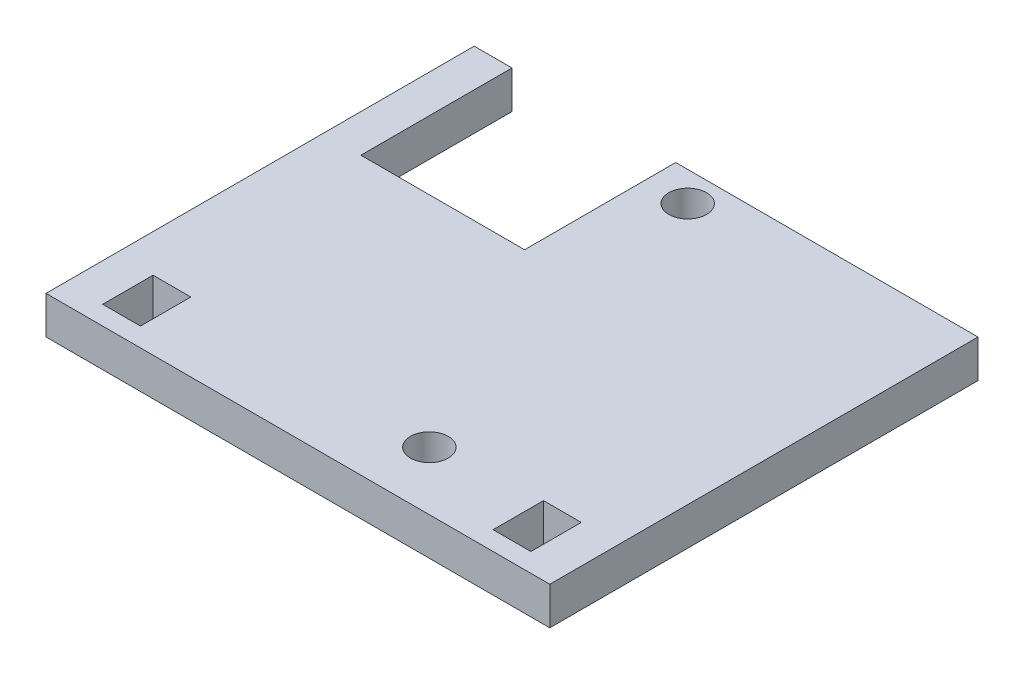
ISO-10303-21;
HEADER;
FILE_DESCRIPTION(('STEP AP214'),'2;1');
FILE_NAME('part.step','',(''),(''),'','','');
FILE_SCHEMA(('AUTOMOTIVE_DESIGN { 1 0 10303 214 1 1 1 1 }'));
ENDSEC;
DATA;
#1=APPLICATION_CONTEXT('core data for automotive mechanical design processes');
#2=APPLICATION_PROTOCOL_DEFINITION('international standard','automotive_design',2000,#1);
#3=PRODUCT_CONTEXT('',#1,'mechanical');
#4=PRODUCT('Part','Part','',(#3));
#5=PRODUCT_RELATED_PRODUCT_CATEGORY('part','',(#4));
#6=PRODUCT_DEFINITION_FORMATION('','',#4);
#7=PRODUCT_DEFINITION_CONTEXT('part definition',#1,'design');
#8=PRODUCT_DEFINITION('design','',#6,#7);
#9=PRODUCT_DEFINITION_SHAPE('','',#8);
#10=(LENGTH_UNIT() NAMED_UNIT(*) SI_UNIT(.MILLI.,.METRE.));
#11=(NAMED_UNIT(*) PLANE_ANGLE_UNIT() SI_UNIT($,.RADIAN.));
#12=(NAMED_UNIT(*) SI_UNIT($,.STERADIAN.) SOLID_ANGLE_UNIT());
#13=UNCERTAINTY_MEASURE_WITH_UNIT(LENGTH_MEASURE(1.E-05),#10,'distance_accuracy_value','');
#14=(GEOMETRIC_REPRESENTATION_CONTEXT(3) GLOBAL_UNCERTAINTY_ASSIGNED_CONTEXT((#13)) GLOBAL_UNIT_ASSIGNED_CONTEXT((#10,
#11,#12)) REPRESENTATION_CONTEXT('',''));
#15=CARTESIAN_POINT('',(0.,0.,0.));
#16=DIRECTION('',(0.,0.,1.));
#17=DIRECTION('',(1.,0.,0.));
#18=AXIS2_PLACEMENT_3D('',#15,#16,#17);
#19=CARTESIAN_POINT('',(0.,3.,0.));
#20=DIRECTION('',(0.,-1.,0.));
#21=DIRECTION('',(0.,0.,-1.));
#22=AXIS2_PLACEMENT_3D('',#19,#20,#21);
#23=PLANE('',#22);
#24=CARTESIAN_POINT('',(19.3,3.,-31.65));
#25=DIRECTION('',(0.,1.,0.));
#26=DIRECTION('',(0.,0.,1.));
#27=AXIS2_PLACEMENT_3D('',#24,#25,#26);
#28=CIRCLE('',#27,1.5);
#29=CARTESIAN_POINT('',(19.3,3.,-30.15));
#30=VERTEX_POINT('',#29);
#31=EDGE_CURVE('E175',#30,#30,#28,.T.);
#32=ORIENTED_EDGE('',*,*,#31,.F.);
#33=EDGE_LOOP('',(#32));
#34=FACE_BOUND('',#33,.T.);
#35=DIRECTION('',(0.,0.,1.));
#36=VECTOR('',#35,1.);
#37=CARTESIAN_POINT('',(3.,3.,-1.5));
#38=LINE('',#37,#36);
#39=CARTESIAN_POINT('',(3.,3.,-5.5));
#40=VERTEX_POINT('',#39);
#41=CARTESIAN_POINT('',(3.,3.,-1.5));
#42=VERTEX_POINT('',#41);
#43=EDGE_CURVE('E185',#40,#42,#38,.T.);
#44=ORIENTED_EDGE('',*,*,#43,.F.);
#45=DIRECTION('',(-1.,0.,0.));
#46=VECTOR('',#45,1.);
#47=CARTESIAN_POINT('',(3.,3.,-5.5));
#48=LINE('',#47,#46);
#49=CARTESIAN_POINT('',(6.,3.,-5.5));
#50=VERTEX_POINT('',#49);
#51=EDGE_CURVE('E193',#50,#40,#48,.T.);
#52=ORIENTED_EDGE('',*,*,#51,.F.);
#53=DIRECTION('',(0.,0.,-1.));
#54=VECTOR('',#53,1.);
#55=CARTESIAN_POINT('',(6.,3.,-1.5));
#56=LINE('',#55,#54);
#57=CARTESIAN_POINT('',(6.,3.,-1.5));
#58=VERTEX_POINT('',#57);
#59=EDGE_CURVE('E190',#58,#50,#56,.T.);
#60=ORIENTED_EDGE('',*,*,#59,.F.);
#61=DIRECTION('',(1.,0.,0.));
#62=VECTOR('',#61,1.);
#63=CARTESIAN_POINT('',(3.,3.,-1.5));
#64=LINE('',#63,#62);
#65=EDGE_CURVE('E187',#42,#58,#64,.T.);
#66=ORIENTED_EDGE('',*,*,#65,.F.);
#67=EDGE_LOOP('',(#44,#52,#60,#66));
#68=FACE_BOUND('',#67,.T.);
#69=DIRECTION('',(0.,0.,1.));
#70=VECTOR('',#69,1.);
#71=CARTESIAN_POINT('',(0.,3.,0.));
#72=LINE('',#71,#70);
#73=CARTESIAN_POINT('',(0.,3.,-34.));
#74=VERTEX_POINT('',#73);
#75=CARTESIAN_POINT('',(0.,3.,0.));
#76=VERTEX_POINT('',#75);
#77=EDGE_CURVE('E216',#74,#76,#72,.T.);
#78=ORIENTED_EDGE('',*,*,#77,.T.);
#79=DIRECTION('',(1.,0.,0.));
#80=VECTOR('',#79,1.);
#81=CARTESIAN_POINT('',(0.,3.,0.));
#82=LINE('',#81,#80);
#83=CARTESIAN_POINT('',(40.,3.,0.));
#84=VERTEX_POINT('',#83);
#85=EDGE_CURVE('E219',#76,#84,#82,.T.);
#86=ORIENTED_EDGE('',*,*,#85,.T.);
#87=DIRECTION('',(0.,0.,-1.));
#88=VECTOR('',#87,1.);
#89=CARTESIAN_POINT('',(40.,3.,0.));
#90=LINE('',#89,#88);
#91=CARTESIAN_POINT('',(40.,3.,-34.));
#92=VERTEX_POINT('',#91);
#93=EDGE_CURVE('E222',#84,#92,#90,.T.);
#94=ORIENTED_EDGE('',*,*,#93,.T.);
#95=DIRECTION('',(-1.,0.,0.));
#96=VECTOR('',#95,1.);
#97=CARTESIAN_POINT('',(16.,3.,-34.));
#98=LINE('',#97,#96);
#99=CARTESIAN_POINT('',(16.,3.,-34.));
#100=VERTEX_POINT('',#99);
#101=EDGE_CURVE('E224',#92,#100,#98,.T.);
#102=ORIENTED_EDGE('',*,*,#101,.T.);
#103=DIRECTION('',(0.,0.,1.));
#104=VECTOR('',#103,1.);
#105=CARTESIAN_POINT('',(16.,3.,-34.));
#106=LINE('',#105,#104);
#107=CARTESIAN_POINT('',(16.,3.,-22.));
#108=VERTEX_POINT('',#107);
#109=EDGE_CURVE('E226',#100,#108,#106,.T.);
#110=ORIENTED_EDGE('',*,*,#109,.T.);
#111=DIRECTION('',(-1.,0.,0.));
#112=VECTOR('',#111,1.);
#113=CARTESIAN_POINT('',(3.,3.,-22.));
#114=LINE('',#113,#112);
#115=CARTESIAN_POINT('',(3.,3.,-22.));
#116=VERTEX_POINT('',#115);
#117=EDGE_CURVE('E228',#108,#116,#114,.T.);
#118=ORIENTED_EDGE('',*,*,#117,.T.);
#119=DIRECTION('',(0.,0.,-1.));
#120=VECTOR('',#119,1.);
#121=CARTESIAN_POINT('',(3.,3.,-34.));
#122=LINE('',#121,#120);
#123=CARTESIAN_POINT('',(3.,3.,-34.));
#124=VERTEX_POINT('',#123);
#125=EDGE_CURVE('E230',#116,#124,#122,.T.);
#126=ORIENTED_EDGE('',*,*,#125,.T.);
#127=DIRECTION('',(-1.,0.,0.));
#128=VECTOR('',#127,1.);
#129=CARTESIAN_POINT('',(0.,3.,-34.));
#130=LINE('',#129,#128);
#131=EDGE_CURVE('E232',#124,#74,#130,.T.);
#132=ORIENTED_EDGE('',*,*,#131,.T.);
#133=EDGE_LOOP('',(#78,#86,#94,#102,#110,#118,#126,#132));
#134=FACE_BOUND('',#133,.T.);
#135=DIRECTION('',(0.,0.,1.));
#136=VECTOR('',#135,1.);
#137=CARTESIAN_POINT('',(34.,3.,-5.5));
#138=LINE('',#137,#136);
#139=CARTESIAN_POINT('',(34.,3.,-5.5));
#140=VERTEX_POINT('',#139);
#141=CARTESIAN_POINT('',(34.,3.,-1.5));
#142=VERTEX_POINT('',#141);
#143=EDGE_CURVE('E146',#140,#142,#138,.T.);
#144=ORIENTED_EDGE('',*,*,#143,.F.);
#145=DIRECTION('',(-1.,0.,0.));
#146=VECTOR('',#145,1.);
#147=CARTESIAN_POINT('',(34.,3.,-5.5));
#148=LINE('',#147,#146);
#149=CARTESIAN_POINT('',(37.,3.,-5.5));
#150=VERTEX_POINT('',#149);
#151=EDGE_CURVE('E169',#150,#140,#148,.T.);
#152=ORIENTED_EDGE('',*,*,#151,.F.);
#153=DIRECTION('',(0.,0.,-1.));
#154=VECTOR('',#153,1.);
#155=CARTESIAN_POINT('',(37.,3.,-5.5));
#156=LINE('',#155,#154);
#157=CARTESIAN_POINT('',(37.,3.,-1.5));
#158=VERTEX_POINT('',#157);
#159=EDGE_CURVE('E167',#158,#150,#156,.T.);
#160=ORIENTED_EDGE('',*,*,#159,.F.);
#161=DIRECTION('',(1.,0.,0.));
#162=VECTOR('',#161,1.);
#163=CARTESIAN_POINT('',(34.,3.,-1.5));
#164=LINE('',#163,#162);
#165=EDGE_CURVE('E154',#142,#158,#164,.T.);
#166=ORIENTED_EDGE('',*,*,#165,.F.);
#167=EDGE_LOOP('',(#144,#152,#160,#166));
#168=FACE_BOUND('',#167,.T.);
#169=CARTESIAN_POINT('',(25.8,3.,-4.64));
#170=DIRECTION('',(0.,1.,0.));
#171=DIRECTION('',(0.,0.,1.));
#172=AXIS2_PLACEMENT_3D('',#169,#170,#171);
#173=CIRCLE('',#172,1.5);
#174=CARTESIAN_POINT('',(25.8,3.,-3.14));
#175=VERTEX_POINT('',#174);
#176=EDGE_CURVE('E384',#175,#175,#173,.T.);
#177=ORIENTED_EDGE('',*,*,#176,.F.);
#178=EDGE_LOOP('',(#177));
#179=FACE_BOUND('',#178,.T.);
#180=ADVANCED_FACE('F33',(#34,#68,#134,#168,#179),#23,.F.);
#181=CARTESIAN_POINT('',(0.,0.,0.));
#182=DIRECTION('',(0.,-1.,0.));
#183=DIRECTION('',(0.,0.,-1.));
#184=AXIS2_PLACEMENT_3D('',#181,#182,#183);
#185=PLANE('',#184);
#186=CARTESIAN_POINT('',(19.3,0.,-31.65));
#187=DIRECTION('',(0.,1.,0.));
#188=DIRECTION('',(0.,0.,1.));
#189=AXIS2_PLACEMENT_3D('',#186,#187,#188);
#190=CIRCLE('',#189,1.5);
#191=CARTESIAN_POINT('',(19.3,0.,-30.15));
#192=VERTEX_POINT('',#191);
#193=EDGE_CURVE('E390',#192,#192,#190,.T.);
#194=ORIENTED_EDGE('',*,*,#193,.T.);
#195=EDGE_LOOP('',(#194));
#196=FACE_BOUND('',#195,.T.);
#197=DIRECTION('',(-1.,0.,0.));
#198=VECTOR('',#197,1.);
#199=CARTESIAN_POINT('',(3.,0.,-5.5));
#200=LINE('',#199,#198);
#201=CARTESIAN_POINT('',(6.,0.,-5.5));
#202=VERTEX_POINT('',#201);
#203=CARTESIAN_POINT('',(3.,0.,-5.5));
#204=VERTEX_POINT('',#203);
#205=EDGE_CURVE('E188',#202,#204,#200,.T.);
#206=ORIENTED_EDGE('',*,*,#205,.T.);
#207=DIRECTION('',(0.,0.,1.));
#208=VECTOR('',#207,1.);
#209=CARTESIAN_POINT('',(3.,0.,-1.5));
#210=LINE('',#209,#208);
#211=CARTESIAN_POINT('',(3.,0.,-1.5));
#212=VERTEX_POINT('',#211);
#213=EDGE_CURVE('E162',#204,#212,#210,.T.);
#214=ORIENTED_EDGE('',*,*,#213,.T.);
#215=DIRECTION('',(1.,0.,0.));
#216=VECTOR('',#215,1.);
#217=CARTESIAN_POINT('',(3.,0.,-1.5));
#218=LINE('',#217,#216);
#219=CARTESIAN_POINT('',(6.,0.,-1.5));
#220=VERTEX_POINT('',#219);
#221=EDGE_CURVE('E198',#212,#220,#218,.T.);
#222=ORIENTED_EDGE('',*,*,#221,.T.);
#223=DIRECTION('',(0.,0.,-1.));
#224=VECTOR('',#223,1.);
#225=CARTESIAN_POINT('',(6.,0.,-1.5));
#226=LINE('',#225,#224);
#227=EDGE_CURVE('E201',#220,#202,#226,.T.);
#228=ORIENTED_EDGE('',*,*,#227,.T.);
#229=EDGE_LOOP('',(#206,#214,#222,#228));
#230=FACE_BOUND('',#229,.T.);
#231=DIRECTION('',(0.,0.,1.));
#232=VECTOR('',#231,1.);
#233=CARTESIAN_POINT('',(0.,0.,0.));
#234=LINE('',#233,#232);
#235=CARTESIAN_POINT('',(0.,0.,-34.));
#236=VERTEX_POINT('',#235);
#237=CARTESIAN_POINT('',(0.,0.,0.));
#238=VERTEX_POINT('',#237);
#239=EDGE_CURVE('E215',#236,#238,#234,.T.);
#240=ORIENTED_EDGE('',*,*,#239,.F.);
#241=DIRECTION('',(-1.,0.,0.));
#242=VECTOR('',#241,1.);
#243=CARTESIAN_POINT('',(0.,0.,-34.));
#244=LINE('',#243,#242);
#245=CARTESIAN_POINT('',(3.,0.,-34.));
#246=VERTEX_POINT('',#245);
#247=EDGE_CURVE('E220',#246,#236,#244,.T.);
#248=ORIENTED_EDGE('',*,*,#247,.F.);
#249=DIRECTION('',(0.,0.,-1.));
#250=VECTOR('',#249,1.);
#251=CARTESIAN_POINT('',(3.,0.,-34.));
#252=LINE('',#251,#250);
#253=CARTESIAN_POINT('',(3.,0.,-22.));
#254=VERTEX_POINT('',#253);
#255=EDGE_CURVE('E247',#254,#246,#252,.T.);
#256=ORIENTED_EDGE('',*,*,#255,.F.);
#257=DIRECTION('',(-1.,0.,0.));
#258=VECTOR('',#257,1.);
#259=CARTESIAN_POINT('',(3.,0.,-22.));
#260=LINE('',#259,#258);
#261=CARTESIAN_POINT('',(16.,0.,-22.));
#262=VERTEX_POINT('',#261);
#263=EDGE_CURVE('E245',#262,#254,#260,.T.);
#264=ORIENTED_EDGE('',*,*,#263,.F.);
#265=DIRECTION('',(0.,0.,1.));
#266=VECTOR('',#265,1.);
#267=CARTESIAN_POINT('',(16.,0.,-34.));
#268=LINE('',#267,#266);
#269=CARTESIAN_POINT('',(16.,0.,-34.));
#270=VERTEX_POINT('',#269);
#271=EDGE_CURVE('E243',#270,#262,#268,.T.);
#272=ORIENTED_EDGE('',*,*,#271,.F.);
#273=DIRECTION('',(-1.,0.,0.));
#274=VECTOR('',#273,1.);
#275=CARTESIAN_POINT('',(16.,0.,-34.));
#276=LINE('',#275,#274);
#277=CARTESIAN_POINT('',(40.,0.,-34.));
#278=VERTEX_POINT('',#277);
#279=EDGE_CURVE('E241',#278,#270,#276,.T.);
#280=ORIENTED_EDGE('',*,*,#279,.F.);
#281=DIRECTION('',(0.,0.,-1.));
#282=VECTOR('',#281,1.);
#283=CARTESIAN_POINT('',(40.,0.,0.));
#284=LINE('',#283,#282);
#285=CARTESIAN_POINT('',(40.,0.,0.));
#286=VERTEX_POINT('',#285);
#287=EDGE_CURVE('E239',#286,#278,#284,.T.);
#288=ORIENTED_EDGE('',*,*,#287,.F.);
#289=DIRECTION('',(1.,0.,0.));
#290=VECTOR('',#289,1.);
#291=CARTESIAN_POINT('',(0.,0.,0.));
#292=LINE('',#291,#290);
#293=EDGE_CURVE('E237',#238,#286,#292,.T.);
#294=ORIENTED_EDGE('',*,*,#293,.F.);
#295=EDGE_LOOP('',(#240,#248,#256,#264,#272,#280,#288,#294));
#296=FACE_BOUND('',#295,.T.);
#297=DIRECTION('',(-1.,0.,0.));
#298=VECTOR('',#297,1.);
#299=CARTESIAN_POINT('',(34.,0.,-5.5));
#300=LINE('',#299,#298);
#301=CARTESIAN_POINT('',(37.,0.,-5.5));
#302=VERTEX_POINT('',#301);
#303=CARTESIAN_POINT('',(34.,0.,-5.5));
#304=VERTEX_POINT('',#303);
#305=EDGE_CURVE('E155',#302,#304,#300,.T.);
#306=ORIENTED_EDGE('',*,*,#305,.T.);
#307=DIRECTION('',(0.,0.,1.));
#308=VECTOR('',#307,1.);
#309=CARTESIAN_POINT('',(34.,0.,-5.5));
#310=LINE('',#309,#308);
#311=CARTESIAN_POINT('',(34.,0.,-1.5));
#312=VERTEX_POINT('',#311);
#313=EDGE_CURVE('E56',#304,#312,#310,.T.);
#314=ORIENTED_EDGE('',*,*,#313,.T.);
#315=DIRECTION('',(1.,0.,0.));
#316=VECTOR('',#315,1.);
#317=CARTESIAN_POINT('',(34.,0.,-1.5));
#318=LINE('',#317,#316);
#319=CARTESIAN_POINT('',(37.,0.,-1.5));
#320=VERTEX_POINT('',#319);
#321=EDGE_CURVE('E161',#312,#320,#318,.T.);
#322=ORIENTED_EDGE('',*,*,#321,.T.);
#323=DIRECTION('',(0.,0.,-1.));
#324=VECTOR('',#323,1.);
#325=CARTESIAN_POINT('',(37.,0.,-5.5));
#326=LINE('',#325,#324);
#327=EDGE_CURVE('E177',#320,#302,#326,.T.);
#328=ORIENTED_EDGE('',*,*,#327,.T.);
#329=EDGE_LOOP('',(#306,#314,#322,#328));
#330=FACE_BOUND('',#329,.T.);
#331=CARTESIAN_POINT('',(25.8,0.,-4.64));
#332=DIRECTION('',(0.,1.,0.));
#333=DIRECTION('',(0.,0.,1.));
#334=AXIS2_PLACEMENT_3D('',#331,#332,#333);
#335=CIRCLE('',#334,1.5);
#336=CARTESIAN_POINT('',(25.8,0.,-3.14));
#337=VERTEX_POINT('',#336);
#338=EDGE_CURVE('E387',#337,#337,#335,.T.);
#339=ORIENTED_EDGE('',*,*,#338,.T.);
#340=EDGE_LOOP('',(#339));
#341=FACE_BOUND('',#340,.T.);
#342=ADVANCED_FACE('F277',(#196,#230,#296,#330,#341),#185,.T.);
#343=CARTESIAN_POINT('',(0.,3.,0.));
#344=DIRECTION('',(1.,0.,0.));
#345=DIRECTION('',(0.,0.,-1.));
#346=AXIS2_PLACEMENT_3D('',#343,#344,#345);
#347=PLANE('',#346);
#348=ORIENTED_EDGE('',*,*,#239,.T.);
#349=DIRECTION('',(0.,-1.,0.));
#350=VECTOR('',#349,1.);
#351=CARTESIAN_POINT('',(0.,3.,0.));
#352=LINE('',#351,#350);
#353=EDGE_CURVE('E11',#76,#238,#352,.T.);
#354=ORIENTED_EDGE('',*,*,#353,.F.);
#355=ORIENTED_EDGE('',*,*,#77,.F.);
#356=DIRECTION('',(0.,-1.,0.));
#357=VECTOR('',#356,1.);
#358=CARTESIAN_POINT('',(0.,3.,-34.));
#359=LINE('',#358,#357);
#360=EDGE_CURVE('E234',#74,#236,#359,.T.);
#361=ORIENTED_EDGE('',*,*,#360,.T.);
#362=EDGE_LOOP('',(#348,#354,#355,#361));
#363=FACE_BOUND('',#362,.T.);
#364=ADVANCED_FACE('F35',(#363),#347,.F.);
#365=CARTESIAN_POINT('',(0.,3.,0.));
#366=DIRECTION('',(0.,0.,-1.));
#367=DIRECTION('',(-1.,0.,0.));
#368=AXIS2_PLACEMENT_3D('',#365,#366,#367);
#369=PLANE('',#368);
#370=ORIENTED_EDGE('',*,*,#293,.T.);
#371=DIRECTION('',(0.,-1.,0.));
#372=VECTOR('',#371,1.);
#373=CARTESIAN_POINT('',(40.,3.,0.));
#374=LINE('',#373,#372);
#375=EDGE_CURVE('E41',#84,#286,#374,.T.);
#376=ORIENTED_EDGE('',*,*,#375,.F.);
#377=ORIENTED_EDGE('',*,*,#85,.F.);
#378=ORIENTED_EDGE('',*,*,#353,.T.);
#379=EDGE_LOOP('',(#370,#376,#377,#378));
#380=FACE_BOUND('',#379,.T.);
#381=ADVANCED_FACE('F294',(#380),#369,.F.);
#382=CARTESIAN_POINT('',(40.,3.,0.));
#383=DIRECTION('',(-1.,0.,0.));
#384=DIRECTION('',(0.,0.,1.));
#385=AXIS2_PLACEMENT_3D('',#382,#383,#384);
#386=PLANE('',#385);
#387=ORIENTED_EDGE('',*,*,#287,.T.);
#388=DIRECTION('',(0.,-1.,0.));
#389=VECTOR('',#388,1.);
#390=CARTESIAN_POINT('',(40.,3.,-34.));
#391=LINE('',#390,#389);
#392=EDGE_CURVE('E264',#92,#278,#391,.T.);
#393=ORIENTED_EDGE('',*,*,#392,.F.);
#394=ORIENTED_EDGE('',*,*,#93,.F.);
#395=ORIENTED_EDGE('',*,*,#375,.T.);
#396=EDGE_LOOP('',(#387,#393,#394,#395));
#397=FACE_BOUND('',#396,.T.);
#398=ADVANCED_FACE('F271',(#397),#386,.F.);
#399=CARTESIAN_POINT('',(16.,3.,-34.));
#400=DIRECTION('',(0.,0.,1.));
#401=DIRECTION('',(1.,0.,0.));
#402=AXIS2_PLACEMENT_3D('',#399,#400,#401);
#403=PLANE('',#402);
#404=ORIENTED_EDGE('',*,*,#279,.T.);
#405=DIRECTION('',(0.,-1.,0.));
#406=VECTOR('',#405,1.);
#407=CARTESIAN_POINT('',(16.,3.,-34.));
#408=LINE('',#407,#406);
#409=EDGE_CURVE('E261',#100,#270,#408,.T.);
#410=ORIENTED_EDGE('',*,*,#409,.F.);
#411=ORIENTED_EDGE('',*,*,#101,.F.);
#412=ORIENTED_EDGE('',*,*,#392,.T.);
#413=EDGE_LOOP('',(#404,#410,#411,#412));
#414=FACE_BOUND('',#413,.T.);
#415=ADVANCED_FACE('F283',(#414),#403,.F.);
#416=CARTESIAN_POINT('',(16.,3.,-34.));
#417=DIRECTION('',(1.,0.,0.));
#418=DIRECTION('',(0.,0.,-1.));
#419=AXIS2_PLACEMENT_3D('',#416,#417,#418);
#420=PLANE('',#419);
#421=ORIENTED_EDGE('',*,*,#271,.T.);
#422=DIRECTION('',(0.,-1.,0.));
#423=VECTOR('',#422,1.);
#424=CARTESIAN_POINT('',(16.,3.,-22.));
#425=LINE('',#424,#423);
#426=EDGE_CURVE('E258',#108,#262,#425,.T.);
#427=ORIENTED_EDGE('',*,*,#426,.F.);
#428=ORIENTED_EDGE('',*,*,#109,.F.);
#429=ORIENTED_EDGE('',*,*,#409,.T.);
#430=EDGE_LOOP('',(#421,#427,#428,#429));
#431=FACE_BOUND('',#430,.T.);
#432=ADVANCED_FACE('F287',(#431),#420,.F.);
#433=CARTESIAN_POINT('',(3.,3.,-22.));
#434=DIRECTION('',(0.,0.,1.));
#435=DIRECTION('',(1.,0.,0.));
#436=AXIS2_PLACEMENT_3D('',#433,#434,#435);
#437=PLANE('',#436);
#438=ORIENTED_EDGE('',*,*,#263,.T.);
#439=DIRECTION('',(0.,-1.,0.));
#440=VECTOR('',#439,1.);
#441=CARTESIAN_POINT('',(3.,3.,-22.));
#442=LINE('',#441,#440);
#443=EDGE_CURVE('E255',#116,#254,#442,.T.);
#444=ORIENTED_EDGE('',*,*,#443,.F.);
#445=ORIENTED_EDGE('',*,*,#117,.F.);
#446=ORIENTED_EDGE('',*,*,#426,.T.);
#447=EDGE_LOOP('',(#438,#444,#445,#446));
#448=FACE_BOUND('',#447,.T.);
#449=ADVANCED_FACE('F307',(#448),#437,.F.);
#450=CARTESIAN_POINT('',(3.,3.,-34.));
#451=DIRECTION('',(-1.,0.,0.));
#452=DIRECTION('',(0.,0.,1.));
#453=AXIS2_PLACEMENT_3D('',#450,#451,#452);
#454=PLANE('',#453);
#455=ORIENTED_EDGE('',*,*,#255,.T.);
#456=DIRECTION('',(0.,-1.,0.));
#457=VECTOR('',#456,1.);
#458=CARTESIAN_POINT('',(3.,3.,-34.));
#459=LINE('',#458,#457);
#460=EDGE_CURVE('E252',#124,#246,#459,.T.);
#461=ORIENTED_EDGE('',*,*,#460,.F.);
#462=ORIENTED_EDGE('',*,*,#125,.F.);
#463=ORIENTED_EDGE('',*,*,#443,.T.);
#464=EDGE_LOOP('',(#455,#461,#462,#463));
#465=FACE_BOUND('',#464,.T.);
#466=ADVANCED_FACE('F305',(#465),#454,.F.);
#467=CARTESIAN_POINT('',(0.,3.,-34.));
#468=DIRECTION('',(0.,0.,1.));
#469=DIRECTION('',(1.,0.,0.));
#470=AXIS2_PLACEMENT_3D('',#467,#468,#469);
#471=PLANE('',#470);
#472=ORIENTED_EDGE('',*,*,#247,.T.);
#473=ORIENTED_EDGE('',*,*,#360,.F.);
#474=ORIENTED_EDGE('',*,*,#131,.F.);
#475=ORIENTED_EDGE('',*,*,#460,.T.);
#476=EDGE_LOOP('',(#472,#473,#474,#475));
#477=FACE_BOUND('',#476,.T.);
#478=ADVANCED_FACE('F300',(#477),#471,.F.);
#479=CARTESIAN_POINT('',(3.,3.,-1.5));
#480=DIRECTION('',(1.,0.,0.));
#481=DIRECTION('',(0.,0.,-1.));
#482=AXIS2_PLACEMENT_3D('',#479,#480,#481);
#483=PLANE('',#482);
#484=ORIENTED_EDGE('',*,*,#213,.F.);
#485=DIRECTION('',(0.,-1.,0.));
#486=VECTOR('',#485,1.);
#487=CARTESIAN_POINT('',(3.,3.,-5.5));
#488=LINE('',#487,#486);
#489=EDGE_CURVE('E195',#40,#204,#488,.T.);
#490=ORIENTED_EDGE('',*,*,#489,.F.);
#491=ORIENTED_EDGE('',*,*,#43,.T.);
#492=DIRECTION('',(0.,-1.,0.));
#493=VECTOR('',#492,1.);
#494=CARTESIAN_POINT('',(3.,3.,-1.5));
#495=LINE('',#494,#493);
#496=EDGE_CURVE('E212',#42,#212,#495,.T.);
#497=ORIENTED_EDGE('',*,*,#496,.T.);
#498=EDGE_LOOP('',(#484,#490,#491,#497));
#499=FACE_BOUND('',#498,.T.);
#500=ADVANCED_FACE('F327',(#499),#483,.T.);
#501=CARTESIAN_POINT('',(3.,3.,-1.5));
#502=DIRECTION('',(0.,0.,-1.));
#503=DIRECTION('',(-1.,0.,0.));
#504=AXIS2_PLACEMENT_3D('',#501,#502,#503);
#505=PLANE('',#504);
#506=ORIENTED_EDGE('',*,*,#221,.F.);
#507=ORIENTED_EDGE('',*,*,#496,.F.);
#508=ORIENTED_EDGE('',*,*,#65,.T.);
#509=DIRECTION('',(0.,-1.,0.));
#510=VECTOR('',#509,1.);
#511=CARTESIAN_POINT('',(6.,3.,-1.5));
#512=LINE('',#511,#510);
#513=EDGE_CURVE('E210',#58,#220,#512,.T.);
#514=ORIENTED_EDGE('',*,*,#513,.T.);
#515=EDGE_LOOP('',(#506,#507,#508,#514));
#516=FACE_BOUND('',#515,.T.);
#517=ADVANCED_FACE('F334',(#516),#505,.T.);
#518=CARTESIAN_POINT('',(6.,3.,-1.5));
#519=DIRECTION('',(-1.,0.,0.));
#520=DIRECTION('',(0.,0.,1.));
#521=AXIS2_PLACEMENT_3D('',#518,#519,#520);
#522=PLANE('',#521);
#523=ORIENTED_EDGE('',*,*,#227,.F.);
#524=ORIENTED_EDGE('',*,*,#513,.F.);
#525=ORIENTED_EDGE('',*,*,#59,.T.);
#526=DIRECTION('',(0.,-1.,0.));
#527=VECTOR('',#526,1.);
#528=CARTESIAN_POINT('',(6.,3.,-5.5));
#529=LINE('',#528,#527);
#530=EDGE_CURVE('E208',#50,#202,#529,.T.);
#531=ORIENTED_EDGE('',*,*,#530,.T.);
#532=EDGE_LOOP('',(#523,#524,#525,#531));
#533=FACE_BOUND('',#532,.T.);
#534=ADVANCED_FACE('F339',(#533),#522,.T.);
#535=CARTESIAN_POINT('',(3.,3.,-5.5));
#536=DIRECTION('',(0.,0.,1.));
#537=DIRECTION('',(1.,0.,0.));
#538=AXIS2_PLACEMENT_3D('',#535,#536,#537);
#539=PLANE('',#538);
#540=ORIENTED_EDGE('',*,*,#205,.F.);
#541=ORIENTED_EDGE('',*,*,#530,.F.);
#542=ORIENTED_EDGE('',*,*,#51,.T.);
#543=ORIENTED_EDGE('',*,*,#489,.T.);
#544=EDGE_LOOP('',(#540,#541,#542,#543));
#545=FACE_BOUND('',#544,.T.);
#546=ADVANCED_FACE('F347',(#545),#539,.T.);
#547=CARTESIAN_POINT('',(34.,3.,-5.5));
#548=DIRECTION('',(1.,0.,0.));
#549=DIRECTION('',(0.,0.,-1.));
#550=AXIS2_PLACEMENT_3D('',#547,#548,#549);
#551=PLANE('',#550);
#552=ORIENTED_EDGE('',*,*,#313,.F.);
#553=DIRECTION('',(0.,-1.,0.));
#554=VECTOR('',#553,1.);
#555=CARTESIAN_POINT('',(34.,3.,-5.5));
#556=LINE('',#555,#554);
#557=EDGE_CURVE('E150',#140,#304,#556,.T.);
#558=ORIENTED_EDGE('',*,*,#557,.F.);
#559=ORIENTED_EDGE('',*,*,#143,.T.);
#560=DIRECTION('',(0.,-1.,0.));
#561=VECTOR('',#560,1.);
#562=CARTESIAN_POINT('',(34.,3.,-1.5));
#563=LINE('',#562,#561);
#564=EDGE_CURVE('E149',#142,#312,#563,.T.);
#565=ORIENTED_EDGE('',*,*,#564,.T.);
#566=EDGE_LOOP('',(#552,#558,#559,#565));
#567=FACE_BOUND('',#566,.T.);
#568=ADVANCED_FACE('F148',(#567),#551,.T.);
#569=CARTESIAN_POINT('',(34.,3.,-1.5));
#570=DIRECTION('',(0.,0.,-1.));
#571=DIRECTION('',(-1.,0.,0.));
#572=AXIS2_PLACEMENT_3D('',#569,#570,#571);
#573=PLANE('',#572);
#574=ORIENTED_EDGE('',*,*,#321,.F.);
#575=ORIENTED_EDGE('',*,*,#564,.F.);
#576=ORIENTED_EDGE('',*,*,#165,.T.);
#577=DIRECTION('',(0.,-1.,0.));
#578=VECTOR('',#577,1.);
#579=CARTESIAN_POINT('',(37.,3.,-1.5));
#580=LINE('',#579,#578);
#581=EDGE_CURVE('E163',#158,#320,#580,.T.);
#582=ORIENTED_EDGE('',*,*,#581,.T.);
#583=EDGE_LOOP('',(#574,#575,#576,#582));
#584=FACE_BOUND('',#583,.T.);
#585=ADVANCED_FACE('F158',(#584),#573,.T.);
#586=CARTESIAN_POINT('',(37.,3.,-5.5));
#587=DIRECTION('',(-1.,0.,0.));
#588=DIRECTION('',(0.,0.,1.));
#589=AXIS2_PLACEMENT_3D('',#586,#587,#588);
#590=PLANE('',#589);
#591=ORIENTED_EDGE('',*,*,#327,.F.);
#592=ORIENTED_EDGE('',*,*,#581,.F.);
#593=ORIENTED_EDGE('',*,*,#159,.T.);
#594=DIRECTION('',(0.,-1.,0.));
#595=VECTOR('',#594,1.);
#596=CARTESIAN_POINT('',(37.,3.,-5.5));
#597=LINE('',#596,#595);
#598=EDGE_CURVE('E48',#150,#302,#597,.T.);
#599=ORIENTED_EDGE('',*,*,#598,.T.);
#600=EDGE_LOOP('',(#591,#592,#593,#599));
#601=FACE_BOUND('',#600,.T.);
#602=ADVANCED_FACE('F365',(#601),#590,.T.);
#603=CARTESIAN_POINT('',(34.,3.,-5.5));
#604=DIRECTION('',(0.,0.,1.));
#605=DIRECTION('',(1.,0.,0.));
#606=AXIS2_PLACEMENT_3D('',#603,#604,#605);
#607=PLANE('',#606);
#608=ORIENTED_EDGE('',*,*,#305,.F.);
#609=ORIENTED_EDGE('',*,*,#598,.F.);
#610=ORIENTED_EDGE('',*,*,#151,.T.);
#611=ORIENTED_EDGE('',*,*,#557,.T.);
#612=EDGE_LOOP('',(#608,#609,#610,#611));
#613=FACE_BOUND('',#612,.T.);
#614=ADVANCED_FACE('F368',(#613),#607,.T.);
#615=CARTESIAN_POINT('',(19.3,3.,-31.65));
#616=DIRECTION('',(0.,-1.,0.));
#617=DIRECTION('',(0.,0.,-1.));
#618=AXIS2_PLACEMENT_3D('',#615,#616,#617);
#619=CYLINDRICAL_SURFACE('',#618,1.5);
#620=ORIENTED_EDGE('',*,*,#31,.T.);
#621=EDGE_LOOP('',(#620));
#622=FACE_BOUND('',#621,.T.);
#623=ORIENTED_EDGE('',*,*,#193,.F.);
#624=EDGE_LOOP('',(#623));
#625=FACE_BOUND('',#624,.T.);
#626=ADVANCED_FACE('F372',(#622,#625),#619,.F.);
#627=CARTESIAN_POINT('',(25.8,3.,-4.64));
#628=DIRECTION('',(0.,-1.,0.));
#629=DIRECTION('',(0.,0.,-1.));
#630=AXIS2_PLACEMENT_3D('',#627,#628,#629);
#631=CYLINDRICAL_SURFACE('',#630,1.5);
#632=ORIENTED_EDGE('',*,*,#176,.T.);
#633=EDGE_LOOP('',(#632));
#634=FACE_BOUND('',#633,.T.);
#635=ORIENTED_EDGE('',*,*,#338,.F.);
#636=EDGE_LOOP('',(#635));
#637=FACE_BOUND('',#636,.T.);
#638=ADVANCED_FACE('F375',(#634,#637),#631,.F.);
#639=CLOSED_SHELL('',(#180,#342,#364,#381,#398,#415,#432,#449,#466,#478,#500,#517,#534,#546,
#568,#585,#602,#614,#626,#638));
#640=MANIFOLD_SOLID_BREP('B2',#639);
#641=ADVANCED_BREP_SHAPE_REPRESENTATION('',(#18,#640),#14);
#642=SHAPE_DEFINITION_REPRESENTATION(#9,#641);
ENDSEC;
END-ISO-10303-21;
